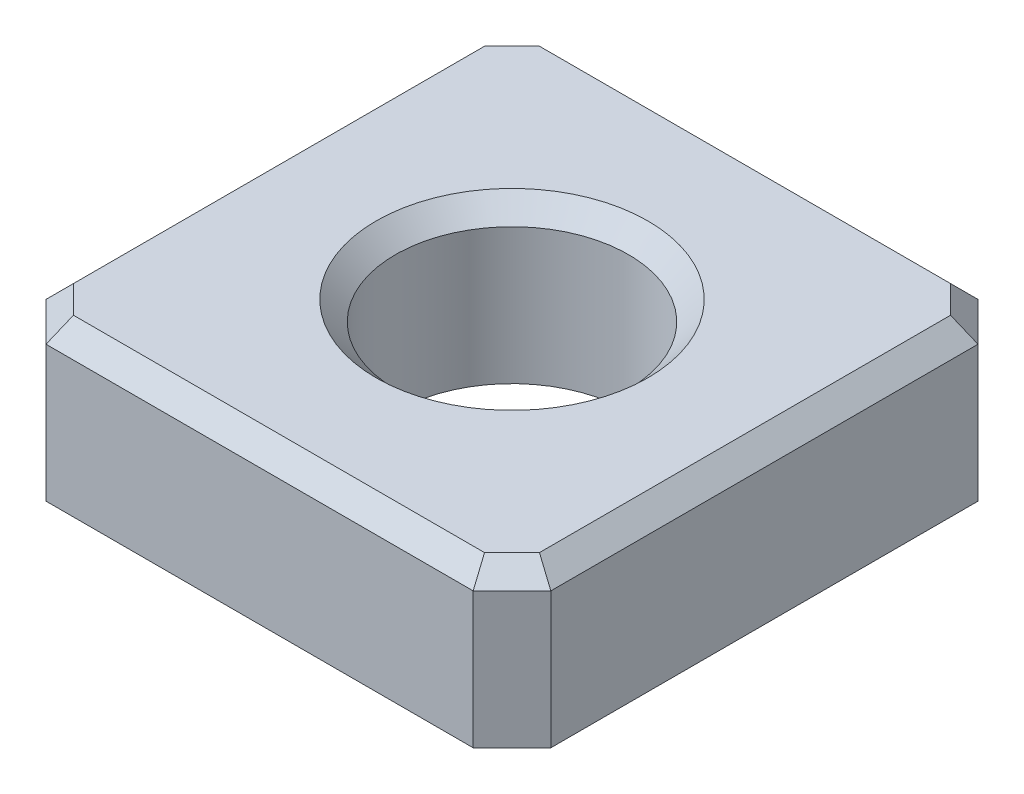
ISO-10303-21;
HEADER;
FILE_DESCRIPTION(('STEP AP214'),'2;1');
FILE_NAME('part.step','',(''),(''),'','','');
FILE_SCHEMA(('AUTOMOTIVE_DESIGN { 1 0 10303 214 1 1 1 1 }'));
ENDSEC;
DATA;
#1=APPLICATION_CONTEXT('core data for automotive mechanical design processes');
#2=APPLICATION_PROTOCOL_DEFINITION('international standard','automotive_design',2000,#1);
#3=PRODUCT_CONTEXT('',#1,'mechanical');
#4=PRODUCT('Part','Part','',(#3));
#5=PRODUCT_RELATED_PRODUCT_CATEGORY('part','',(#4));
#6=PRODUCT_DEFINITION_FORMATION('','',#4);
#7=PRODUCT_DEFINITION_CONTEXT('part definition',#1,'design');
#8=PRODUCT_DEFINITION('design','',#6,#7);
#9=PRODUCT_DEFINITION_SHAPE('','',#8);
#10=(LENGTH_UNIT() NAMED_UNIT(*) SI_UNIT(.MILLI.,.METRE.));
#11=(NAMED_UNIT(*) PLANE_ANGLE_UNIT() SI_UNIT($,.RADIAN.));
#12=(NAMED_UNIT(*) SI_UNIT($,.STERADIAN.) SOLID_ANGLE_UNIT());
#13=UNCERTAINTY_MEASURE_WITH_UNIT(LENGTH_MEASURE(1.E-05),#10,'distance_accuracy_value','');
#14=(GEOMETRIC_REPRESENTATION_CONTEXT(3) GLOBAL_UNCERTAINTY_ASSIGNED_CONTEXT((#13)) GLOBAL_UNIT_ASSIGNED_CONTEXT((#10,
#11,#12)) REPRESENTATION_CONTEXT('',''));
#15=CARTESIAN_POINT('',(0.,0.,0.));
#16=DIRECTION('',(0.,0.,1.));
#17=DIRECTION('',(1.,0.,0.));
#18=AXIS2_PLACEMENT_3D('',#15,#16,#17);
#19=CARTESIAN_POINT('',(0.,4.,0.));
#20=DIRECTION('',(0.,1.,0.));
#21=DIRECTION('',(0.,0.,1.));
#22=AXIS2_PLACEMENT_3D('',#19,#20,#21);
#23=PLANE('',#22);
#24=CARTESIAN_POINT('',(0.,4.,0.));
#25=DIRECTION('',(0.,1.,0.));
#26=DIRECTION('',(0.,0.,1.));
#27=AXIS2_PLACEMENT_3D('',#24,#25,#26);
#28=CIRCLE('',#27,3.5);
#29=CARTESIAN_POINT('',(0.,4.,3.5));
#30=VERTEX_POINT('',#29);
#31=EDGE_CURVE('E225',#30,#30,#28,.F.);
#32=ORIENTED_EDGE('',*,*,#31,.T.);
#33=EDGE_LOOP('',(#32));
#34=FACE_BOUND('',#33,.T.);
#35=DIRECTION('',(0.,0.,-1.));
#36=VECTOR('',#35,1.);
#37=CARTESIAN_POINT('',(6.00000000000003,4.,-5.5));
#38=LINE('',#37,#36);
#39=CARTESIAN_POINT('',(6.00000000000003,4.,5.29289321881345));
#40=VERTEX_POINT('',#39);
#41=CARTESIAN_POINT('',(6.00000000000003,4.,-5.29289321881345));
#42=VERTEX_POINT('',#41);
#43=EDGE_CURVE('E218',#40,#42,#38,.T.);
#44=ORIENTED_EDGE('',*,*,#43,.T.);
#45=DIRECTION('',(-0.707106781186546,0.,-0.707106781186549));
#46=VECTOR('',#45,1.);
#47=CARTESIAN_POINT('',(5.64644660940675,4.,-5.64644660940673));
#48=LINE('',#47,#46);
#49=CARTESIAN_POINT('',(5.29289321881349,4.,-6.));
#50=VERTEX_POINT('',#49);
#51=EDGE_CURVE('E221',#42,#50,#48,.T.);
#52=ORIENTED_EDGE('',*,*,#51,.T.);
#53=DIRECTION('',(-1.,0.,0.));
#54=VECTOR('',#53,1.);
#55=CARTESIAN_POINT('',(-5.50000000000003,4.,-6.));
#56=LINE('',#55,#54);
#57=CARTESIAN_POINT('',(-5.29289321881348,4.,-6.));
#58=VERTEX_POINT('',#57);
#59=EDGE_CURVE('E200',#50,#58,#56,.T.);
#60=ORIENTED_EDGE('',*,*,#59,.T.);
#61=DIRECTION('',(-0.707106781186549,0.,0.707106781186546));
#62=VECTOR('',#61,1.);
#63=CARTESIAN_POINT('',(-5.64644660940673,4.,-5.64644660940675));
#64=LINE('',#63,#62);
#65=CARTESIAN_POINT('',(-6.00000000000003,4.,-5.29289321881345));
#66=VERTEX_POINT('',#65);
#67=EDGE_CURVE('E203',#58,#66,#64,.T.);
#68=ORIENTED_EDGE('',*,*,#67,.T.);
#69=DIRECTION('',(0.,0.,1.));
#70=VECTOR('',#69,1.);
#71=CARTESIAN_POINT('',(-6.00000000000003,4.,5.5));
#72=LINE('',#71,#70);
#73=CARTESIAN_POINT('',(-6.00000000000003,4.,5.29289321881345));
#74=VERTEX_POINT('',#73);
#75=EDGE_CURVE('E206',#66,#74,#72,.T.);
#76=ORIENTED_EDGE('',*,*,#75,.T.);
#77=DIRECTION('',(0.707106781186546,0.,0.707106781186549));
#78=VECTOR('',#77,1.);
#79=CARTESIAN_POINT('',(-5.64644660940675,4.,5.64644660940673));
#80=LINE('',#79,#78);
#81=CARTESIAN_POINT('',(-5.29289321881349,4.,6.));
#82=VERTEX_POINT('',#81);
#83=EDGE_CURVE('E209',#74,#82,#80,.T.);
#84=ORIENTED_EDGE('',*,*,#83,.T.);
#85=DIRECTION('',(1.,0.,0.));
#86=VECTOR('',#85,1.);
#87=CARTESIAN_POINT('',(5.50000000000003,4.,6.));
#88=LINE('',#87,#86);
#89=CARTESIAN_POINT('',(5.29289321881348,4.,6.));
#90=VERTEX_POINT('',#89);
#91=EDGE_CURVE('E212',#82,#90,#88,.T.);
#92=ORIENTED_EDGE('',*,*,#91,.T.);
#93=DIRECTION('',(0.707106781186549,0.,-0.707106781186546));
#94=VECTOR('',#93,1.);
#95=CARTESIAN_POINT('',(5.64644660940673,4.,5.64644660940675));
#96=LINE('',#95,#94);
#97=EDGE_CURVE('E215',#90,#40,#96,.T.);
#98=ORIENTED_EDGE('',*,*,#97,.T.);
#99=EDGE_LOOP('',(#44,#52,#60,#68,#76,#84,#92,#98));
#100=FACE_BOUND('',#99,.T.);
#101=ADVANCED_FACE('F41',(#34,#100),#23,.T.);
#102=CARTESIAN_POINT('',(0.,0.,0.));
#103=DIRECTION('',(0.,1.,0.));
#104=DIRECTION('',(0.,0.,1.));
#105=AXIS2_PLACEMENT_3D('',#102,#103,#104);
#106=PLANE('',#105);
#107=DIRECTION('',(0.,0.,1.));
#108=VECTOR('',#107,1.);
#109=CARTESIAN_POINT('',(-6.50000000000003,0.,-6.5));
#110=LINE('',#109,#108);
#111=CARTESIAN_POINT('',(-6.50000000000003,0.,-5.5));
#112=VERTEX_POINT('',#111);
#113=CARTESIAN_POINT('',(-6.50000000000003,0.,5.5));
#114=VERTEX_POINT('',#113);
#115=EDGE_CURVE('E136',#112,#114,#110,.T.);
#116=ORIENTED_EDGE('',*,*,#115,.F.);
#117=DIRECTION('',(-0.707106781186549,0.,0.707106781186546));
#118=VECTOR('',#117,1.);
#119=CARTESIAN_POINT('',(-6.50000000000003,0.,-5.5));
#120=LINE('',#119,#118);
#121=CARTESIAN_POINT('',(-5.50000000000003,0.,-6.5));
#122=VERTEX_POINT('',#121);
#123=EDGE_CURVE('E143',#112,#122,#120,.F.);
#124=ORIENTED_EDGE('',*,*,#123,.T.);
#125=DIRECTION('',(-1.,0.,0.));
#126=VECTOR('',#125,1.);
#127=CARTESIAN_POINT('',(-6.50000000000003,0.,-6.5));
#128=LINE('',#127,#126);
#129=CARTESIAN_POINT('',(5.50000000000003,0.,-6.5));
#130=VERTEX_POINT('',#129);
#131=EDGE_CURVE('E159',#130,#122,#128,.T.);
#132=ORIENTED_EDGE('',*,*,#131,.F.);
#133=DIRECTION('',(-0.707106781186546,0.,-0.707106781186549));
#134=VECTOR('',#133,1.);
#135=CARTESIAN_POINT('',(5.50000000000003,0.,-6.5));
#136=LINE('',#135,#134);
#137=CARTESIAN_POINT('',(6.50000000000003,0.,-5.5));
#138=VERTEX_POINT('',#137);
#139=EDGE_CURVE('E173',#130,#138,#136,.F.);
#140=ORIENTED_EDGE('',*,*,#139,.T.);
#141=DIRECTION('',(0.,0.,-1.));
#142=VECTOR('',#141,1.);
#143=CARTESIAN_POINT('',(6.50000000000003,0.,-6.5));
#144=LINE('',#143,#142);
#145=CARTESIAN_POINT('',(6.50000000000003,0.,5.5));
#146=VERTEX_POINT('',#145);
#147=EDGE_CURVE('E165',#146,#138,#144,.T.);
#148=ORIENTED_EDGE('',*,*,#147,.F.);
#149=DIRECTION('',(0.707106781186549,0.,-0.707106781186546));
#150=VECTOR('',#149,1.);
#151=CARTESIAN_POINT('',(6.50000000000003,0.,5.5));
#152=LINE('',#151,#150);
#153=CARTESIAN_POINT('',(5.50000000000003,0.,6.5));
#154=VERTEX_POINT('',#153);
#155=EDGE_CURVE('E140',#146,#154,#152,.F.);
#156=ORIENTED_EDGE('',*,*,#155,.T.);
#157=DIRECTION('',(1.,0.,0.));
#158=VECTOR('',#157,1.);
#159=CARTESIAN_POINT('',(-6.50000000000003,0.,6.5));
#160=LINE('',#159,#158);
#161=CARTESIAN_POINT('',(-5.50000000000003,0.,6.5));
#162=VERTEX_POINT('',#161);
#163=EDGE_CURVE('E158',#162,#154,#160,.T.);
#164=ORIENTED_EDGE('',*,*,#163,.F.);
#165=DIRECTION('',(0.707106781186546,0.,0.707106781186549));
#166=VECTOR('',#165,1.);
#167=CARTESIAN_POINT('',(-5.50000000000003,0.,6.5));
#168=LINE('',#167,#166);
#169=EDGE_CURVE('E151',#162,#114,#168,.F.);
#170=ORIENTED_EDGE('',*,*,#169,.T.);
#171=EDGE_LOOP('',(#116,#124,#132,#140,#148,#156,#164,#170));
#172=FACE_BOUND('',#171,.T.);
#173=CARTESIAN_POINT('',(0.,0.,0.));
#174=DIRECTION('',(0.,1.,0.));
#175=DIRECTION('',(0.,0.,1.));
#176=AXIS2_PLACEMENT_3D('',#173,#174,#175);
#177=CIRCLE('',#176,3.);
#178=CARTESIAN_POINT('',(0.,0.,3.));
#179=VERTEX_POINT('',#178);
#180=EDGE_CURVE('E278',#179,#179,#177,.T.);
#181=ORIENTED_EDGE('',*,*,#180,.T.);
#182=EDGE_LOOP('',(#181));
#183=FACE_BOUND('',#182,.T.);
#184=ADVANCED_FACE('F153',(#172,#183),#106,.F.);
#185=CARTESIAN_POINT('',(6.50000000000003,4.,-6.5));
#186=DIRECTION('',(-1.,0.,0.));
#187=DIRECTION('',(0.,0.,1.));
#188=AXIS2_PLACEMENT_3D('',#185,#186,#187);
#189=PLANE('',#188);
#190=DIRECTION('',(0.,1.,0.));
#191=VECTOR('',#190,1.);
#192=CARTESIAN_POINT('',(6.50000000000003,4.,-5.5));
#193=LINE('',#192,#191);
#194=CARTESIAN_POINT('',(6.50000000000003,3.5,-5.5));
#195=VERTEX_POINT('',#194);
#196=EDGE_CURVE('E192',#138,#195,#193,.T.);
#197=ORIENTED_EDGE('',*,*,#196,.T.);
#198=DIRECTION('',(0.,0.,1.));
#199=VECTOR('',#198,1.);
#200=CARTESIAN_POINT('',(6.50000000000003,3.5,5.5));
#201=LINE('',#200,#199);
#202=CARTESIAN_POINT('',(6.50000000000003,3.5,5.5));
#203=VERTEX_POINT('',#202);
#204=EDGE_CURVE('E233',#195,#203,#201,.T.);
#205=ORIENTED_EDGE('',*,*,#204,.T.);
#206=DIRECTION('',(0.,-1.,0.));
#207=VECTOR('',#206,1.);
#208=CARTESIAN_POINT('',(6.50000000000003,4.,5.5));
#209=LINE('',#208,#207);
#210=EDGE_CURVE('E189',#203,#146,#209,.T.);
#211=ORIENTED_EDGE('',*,*,#210,.T.);
#212=ORIENTED_EDGE('',*,*,#147,.T.);
#213=EDGE_LOOP('',(#197,#205,#211,#212));
#214=FACE_BOUND('',#213,.T.);
#215=ADVANCED_FACE('F292',(#214),#189,.F.);
#216=CARTESIAN_POINT('',(-6.50000000000003,4.,-6.5));
#217=DIRECTION('',(0.,0.,1.));
#218=DIRECTION('',(1.,0.,0.));
#219=AXIS2_PLACEMENT_3D('',#216,#217,#218);
#220=PLANE('',#219);
#221=DIRECTION('',(0.,1.,0.));
#222=VECTOR('',#221,1.);
#223=CARTESIAN_POINT('',(-5.50000000000003,4.,-6.5));
#224=LINE('',#223,#222);
#225=CARTESIAN_POINT('',(-5.50000000000003,3.5,-6.5));
#226=VERTEX_POINT('',#225);
#227=EDGE_CURVE('E145',#122,#226,#224,.T.);
#228=ORIENTED_EDGE('',*,*,#227,.T.);
#229=DIRECTION('',(1.,0.,0.));
#230=VECTOR('',#229,1.);
#231=CARTESIAN_POINT('',(5.50000000000003,3.5,-6.5));
#232=LINE('',#231,#230);
#233=CARTESIAN_POINT('',(5.50000000000003,3.5,-6.5));
#234=VERTEX_POINT('',#233);
#235=EDGE_CURVE('E11',#226,#234,#232,.T.);
#236=ORIENTED_EDGE('',*,*,#235,.T.);
#237=DIRECTION('',(0.,-1.,0.));
#238=VECTOR('',#237,1.);
#239=CARTESIAN_POINT('',(5.50000000000003,4.,-6.5));
#240=LINE('',#239,#238);
#241=EDGE_CURVE('E150',#234,#130,#240,.T.);
#242=ORIENTED_EDGE('',*,*,#241,.T.);
#243=ORIENTED_EDGE('',*,*,#131,.T.);
#244=EDGE_LOOP('',(#228,#236,#242,#243));
#245=FACE_BOUND('',#244,.T.);
#246=ADVANCED_FACE('F360',(#245),#220,.F.);
#247=CARTESIAN_POINT('',(-6.50000000000003,4.,-6.5));
#248=DIRECTION('',(1.,0.,0.));
#249=DIRECTION('',(0.,0.,-1.));
#250=AXIS2_PLACEMENT_3D('',#247,#248,#249);
#251=PLANE('',#250);
#252=DIRECTION('',(0.,1.,0.));
#253=VECTOR('',#252,1.);
#254=CARTESIAN_POINT('',(-6.50000000000003,4.,5.5));
#255=LINE('',#254,#253);
#256=CARTESIAN_POINT('',(-6.50000000000003,3.5,5.5));
#257=VERTEX_POINT('',#256);
#258=EDGE_CURVE('E141',#114,#257,#255,.T.);
#259=ORIENTED_EDGE('',*,*,#258,.T.);
#260=DIRECTION('',(0.,0.,-1.));
#261=VECTOR('',#260,1.);
#262=CARTESIAN_POINT('',(-6.50000000000003,3.5,-5.5));
#263=LINE('',#262,#261);
#264=CARTESIAN_POINT('',(-6.50000000000003,3.5,-5.5));
#265=VERTEX_POINT('',#264);
#266=EDGE_CURVE('E67',#257,#265,#263,.T.);
#267=ORIENTED_EDGE('',*,*,#266,.T.);
#268=DIRECTION('',(0.,-1.,0.));
#269=VECTOR('',#268,1.);
#270=CARTESIAN_POINT('',(-6.50000000000003,4.,-5.5));
#271=LINE('',#270,#269);
#272=EDGE_CURVE('E132',#265,#112,#271,.T.);
#273=ORIENTED_EDGE('',*,*,#272,.T.);
#274=ORIENTED_EDGE('',*,*,#115,.T.);
#275=EDGE_LOOP('',(#259,#267,#273,#274));
#276=FACE_BOUND('',#275,.T.);
#277=ADVANCED_FACE('F134',(#276),#251,.F.);
#278=CARTESIAN_POINT('',(-6.50000000000003,4.,6.5));
#279=DIRECTION('',(0.,0.,-1.));
#280=DIRECTION('',(-1.,0.,0.));
#281=AXIS2_PLACEMENT_3D('',#278,#279,#280);
#282=PLANE('',#281);
#283=DIRECTION('',(0.,1.,0.));
#284=VECTOR('',#283,1.);
#285=CARTESIAN_POINT('',(5.50000000000003,4.,6.5));
#286=LINE('',#285,#284);
#287=CARTESIAN_POINT('',(5.50000000000003,3.5,6.5));
#288=VERTEX_POINT('',#287);
#289=EDGE_CURVE('E182',#154,#288,#286,.T.);
#290=ORIENTED_EDGE('',*,*,#289,.T.);
#291=DIRECTION('',(-1.,0.,0.));
#292=VECTOR('',#291,1.);
#293=CARTESIAN_POINT('',(-5.50000000000003,3.5,6.5));
#294=LINE('',#293,#292);
#295=CARTESIAN_POINT('',(-5.50000000000003,3.5,6.5));
#296=VERTEX_POINT('',#295);
#297=EDGE_CURVE('E239',#288,#296,#294,.T.);
#298=ORIENTED_EDGE('',*,*,#297,.T.);
#299=DIRECTION('',(0.,-1.,0.));
#300=VECTOR('',#299,1.);
#301=CARTESIAN_POINT('',(-5.50000000000003,4.,6.5));
#302=LINE('',#301,#300);
#303=EDGE_CURVE('E186',#296,#162,#302,.T.);
#304=ORIENTED_EDGE('',*,*,#303,.T.);
#305=ORIENTED_EDGE('',*,*,#163,.T.);
#306=EDGE_LOOP('',(#290,#298,#304,#305));
#307=FACE_BOUND('',#306,.T.);
#308=ADVANCED_FACE('F328',(#307),#282,.F.);
#309=CARTESIAN_POINT('',(0.,4.,0.));
#310=DIRECTION('',(0.,-1.,0.));
#311=DIRECTION('',(0.,0.,-1.));
#312=AXIS2_PLACEMENT_3D('',#309,#310,#311);
#313=CYLINDRICAL_SURFACE('',#312,3.);
#314=CARTESIAN_POINT('',(0.,3.5,0.));
#315=DIRECTION('',(0.,1.,0.));
#316=DIRECTION('',(0.,0.,1.));
#317=AXIS2_PLACEMENT_3D('',#314,#315,#316);
#318=CIRCLE('',#317,3.);
#319=CARTESIAN_POINT('',(0.,3.5,3.));
#320=VERTEX_POINT('',#319);
#321=EDGE_CURVE('E196',#320,#320,#318,.T.);
#322=ORIENTED_EDGE('',*,*,#321,.T.);
#323=EDGE_LOOP('',(#322));
#324=FACE_BOUND('',#323,.T.);
#325=ORIENTED_EDGE('',*,*,#180,.F.);
#326=EDGE_LOOP('',(#325));
#327=FACE_BOUND('',#326,.T.);
#328=ADVANCED_FACE('F354',(#324,#327),#313,.F.);
#329=CARTESIAN_POINT('',(-6.50000000000003,4.,-5.5));
#330=DIRECTION('',(0.707106781186546,0.,0.707106781186549));
#331=DIRECTION('',(0.,-1.,0.));
#332=AXIS2_PLACEMENT_3D('',#329,#330,#331);
#333=PLANE('',#332);
#334=ORIENTED_EDGE('',*,*,#272,.F.);
#335=DIRECTION('',(-0.707106781186549,0.,0.707106781186546));
#336=VECTOR('',#335,1.);
#337=CARTESIAN_POINT('',(-6.50000000000003,3.5,-5.5));
#338=LINE('',#337,#336);
#339=EDGE_CURVE('E52',#265,#226,#338,.F.);
#340=ORIENTED_EDGE('',*,*,#339,.T.);
#341=ORIENTED_EDGE('',*,*,#227,.F.);
#342=ORIENTED_EDGE('',*,*,#123,.F.);
#343=EDGE_LOOP('',(#334,#340,#341,#342));
#344=FACE_BOUND('',#343,.T.);
#345=ADVANCED_FACE('F144',(#344),#333,.F.);
#346=CARTESIAN_POINT('',(-5.50000000000003,4.,6.5));
#347=DIRECTION('',(0.707106781186549,0.,-0.707106781186546));
#348=DIRECTION('',(0.,-1.,0.));
#349=AXIS2_PLACEMENT_3D('',#346,#347,#348);
#350=PLANE('',#349);
#351=ORIENTED_EDGE('',*,*,#303,.F.);
#352=DIRECTION('',(0.707106781186546,0.,0.707106781186549));
#353=VECTOR('',#352,1.);
#354=CARTESIAN_POINT('',(-5.50000000000003,3.5,6.5));
#355=LINE('',#354,#353);
#356=EDGE_CURVE('E242',#296,#257,#355,.F.);
#357=ORIENTED_EDGE('',*,*,#356,.T.);
#358=ORIENTED_EDGE('',*,*,#258,.F.);
#359=ORIENTED_EDGE('',*,*,#169,.F.);
#360=EDGE_LOOP('',(#351,#357,#358,#359));
#361=FACE_BOUND('',#360,.T.);
#362=ADVANCED_FACE('F331',(#361),#350,.F.);
#363=CARTESIAN_POINT('',(5.50000000000003,4.,-6.5));
#364=DIRECTION('',(-0.707106781186549,0.,0.707106781186546));
#365=DIRECTION('',(0.,-1.,0.));
#366=AXIS2_PLACEMENT_3D('',#363,#364,#365);
#367=PLANE('',#366);
#368=ORIENTED_EDGE('',*,*,#241,.F.);
#369=DIRECTION('',(-0.707106781186546,0.,-0.707106781186549));
#370=VECTOR('',#369,1.);
#371=CARTESIAN_POINT('',(5.50000000000003,3.5,-6.5));
#372=LINE('',#371,#370);
#373=EDGE_CURVE('E229',#234,#195,#372,.F.);
#374=ORIENTED_EDGE('',*,*,#373,.T.);
#375=ORIENTED_EDGE('',*,*,#196,.F.);
#376=ORIENTED_EDGE('',*,*,#139,.F.);
#377=EDGE_LOOP('',(#368,#374,#375,#376));
#378=FACE_BOUND('',#377,.T.);
#379=ADVANCED_FACE('F298',(#378),#367,.F.);
#380=CARTESIAN_POINT('',(6.50000000000003,4.,5.5));
#381=DIRECTION('',(-0.707106781186546,0.,-0.707106781186549));
#382=DIRECTION('',(0.,-1.,0.));
#383=AXIS2_PLACEMENT_3D('',#380,#381,#382);
#384=PLANE('',#383);
#385=ORIENTED_EDGE('',*,*,#210,.F.);
#386=DIRECTION('',(0.707106781186549,0.,-0.707106781186546));
#387=VECTOR('',#386,1.);
#388=CARTESIAN_POINT('',(6.50000000000003,3.5,5.5));
#389=LINE('',#388,#387);
#390=EDGE_CURVE('E236',#203,#288,#389,.F.);
#391=ORIENTED_EDGE('',*,*,#390,.T.);
#392=ORIENTED_EDGE('',*,*,#289,.F.);
#393=ORIENTED_EDGE('',*,*,#155,.F.);
#394=EDGE_LOOP('',(#385,#391,#392,#393));
#395=FACE_BOUND('',#394,.T.);
#396=ADVANCED_FACE('F320',(#395),#384,.F.);
#397=CARTESIAN_POINT('',(0.,3.5,0.));
#398=DIRECTION('',(0.,1.,0.));
#399=DIRECTION('',(0.,0.,1.));
#400=AXIS2_PLACEMENT_3D('',#397,#398,#399);
#401=CONICAL_SURFACE('',#400,3.,0.78539816339745);
#402=ORIENTED_EDGE('',*,*,#31,.F.);
#403=EDGE_LOOP('',(#402));
#404=FACE_BOUND('',#403,.T.);
#405=ORIENTED_EDGE('',*,*,#321,.F.);
#406=EDGE_LOOP('',(#405));
#407=FACE_BOUND('',#406,.T.);
#408=ADVANCED_FACE('F387',(#404,#407),#401,.F.);
#409=CARTESIAN_POINT('',(-5.64644660940675,4.,5.64644660940673));
#410=DIRECTION('',(-0.5,0.707106781186548,0.499999999999999));
#411=DIRECTION('',(-0.707106781186546,0.,-0.707106781186549));
#412=AXIS2_PLACEMENT_3D('',#409,#410,#411);
#413=PLANE('',#412);
#414=DIRECTION('',(0.678598344545847,0.678598344545847,-0.281084637714821));
#415=VECTOR('',#414,1.);
#416=CARTESIAN_POINT('',(-4.99041465271166,5.00958534728837,4.87470927559345));
#417=LINE('',#416,#415);
#418=EDGE_CURVE('E270',#257,#74,#417,.T.);
#419=ORIENTED_EDGE('',*,*,#418,.F.);
#420=ORIENTED_EDGE('',*,*,#356,.F.);
#421=DIRECTION('',(0.281084637714823,0.678598344545847,-0.678598344545847));
#422=VECTOR('',#421,1.);
#423=CARTESIAN_POINT('',(-5.25338893203385,4.09537178491527,5.90462821508473));
#424=LINE('',#423,#422);
#425=EDGE_CURVE('E46',#82,#296,#424,.F.);
#426=ORIENTED_EDGE('',*,*,#425,.F.);
#427=ORIENTED_EDGE('',*,*,#83,.F.);
#428=EDGE_LOOP('',(#419,#420,#426,#427));
#429=FACE_BOUND('',#428,.T.);
#430=ADVANCED_FACE('F44',(#429),#413,.T.);
#431=CARTESIAN_POINT('',(0.,4.,6.));
#432=DIRECTION('',(0.,0.707106781186547,0.707106781186547));
#433=DIRECTION('',(-1.,0.,0.));
#434=AXIS2_PLACEMENT_3D('',#431,#432,#433);
#435=PLANE('',#434);
#436=ORIENTED_EDGE('',*,*,#425,.T.);
#437=ORIENTED_EDGE('',*,*,#297,.F.);
#438=DIRECTION('',(-0.281084637714821,0.678598344545847,-0.678598344545847));
#439=VECTOR('',#438,1.);
#440=CARTESIAN_POINT('',(4.87470927559348,5.00958534728838,4.99041465271162));
#441=LINE('',#440,#439);
#442=EDGE_CURVE('E267',#90,#288,#441,.F.);
#443=ORIENTED_EDGE('',*,*,#442,.F.);
#444=ORIENTED_EDGE('',*,*,#91,.F.);
#445=EDGE_LOOP('',(#436,#437,#443,#444));
#446=FACE_BOUND('',#445,.T.);
#447=ADVANCED_FACE('F325',(#446),#435,.T.);
#448=CARTESIAN_POINT('',(-6.00000000000003,4.,0.));
#449=DIRECTION('',(-0.707106781186547,0.707106781186547,0.));
#450=DIRECTION('',(0.,0.,-1.));
#451=AXIS2_PLACEMENT_3D('',#448,#449,#450);
#452=PLANE('',#451);
#453=ORIENTED_EDGE('',*,*,#418,.T.);
#454=ORIENTED_EDGE('',*,*,#75,.F.);
#455=DIRECTION('',(0.678598344545847,0.678598344545847,0.281084637714822));
#456=VECTOR('',#455,1.);
#457=CARTESIAN_POINT('',(-5.90462821508475,4.09537178491528,-5.25338893203381));
#458=LINE('',#457,#456);
#459=EDGE_CURVE('E263',#265,#66,#458,.T.);
#460=ORIENTED_EDGE('',*,*,#459,.F.);
#461=ORIENTED_EDGE('',*,*,#266,.F.);
#462=EDGE_LOOP('',(#453,#454,#460,#461));
#463=FACE_BOUND('',#462,.T.);
#464=ADVANCED_FACE('F334',(#463),#452,.T.);
#465=CARTESIAN_POINT('',(5.64644660940673,4.,5.64644660940675));
#466=DIRECTION('',(0.499999999999999,0.707106781186548,0.500000000000001));
#467=DIRECTION('',(-0.707106781186549,0.,0.707106781186546));
#468=AXIS2_PLACEMENT_3D('',#465,#466,#467);
#469=PLANE('',#468);
#470=ORIENTED_EDGE('',*,*,#442,.T.);
#471=ORIENTED_EDGE('',*,*,#390,.F.);
#472=DIRECTION('',(-0.678598344545847,0.678598344545847,-0.281084637714822));
#473=VECTOR('',#472,1.);
#474=CARTESIAN_POINT('',(5.90462821508475,4.09537178491528,5.25338893203381));
#475=LINE('',#474,#473);
#476=EDGE_CURVE('E259',#40,#203,#475,.F.);
#477=ORIENTED_EDGE('',*,*,#476,.F.);
#478=ORIENTED_EDGE('',*,*,#97,.F.);
#479=EDGE_LOOP('',(#470,#471,#477,#478));
#480=FACE_BOUND('',#479,.T.);
#481=ADVANCED_FACE('F323',(#480),#469,.T.);
#482=CARTESIAN_POINT('',(-5.64644660940673,4.,-5.64644660940675));
#483=DIRECTION('',(-0.499999999999999,0.707106781186548,-0.500000000000001));
#484=DIRECTION('',(0.707106781186549,0.,-0.707106781186546));
#485=AXIS2_PLACEMENT_3D('',#482,#483,#484);
#486=PLANE('',#485);
#487=ORIENTED_EDGE('',*,*,#459,.T.);
#488=ORIENTED_EDGE('',*,*,#67,.F.);
#489=DIRECTION('',(0.281084637714821,0.678598344545847,0.678598344545847));
#490=VECTOR('',#489,1.);
#491=CARTESIAN_POINT('',(-4.87470927559348,5.00958534728838,-4.99041465271162));
#492=LINE('',#491,#490);
#493=EDGE_CURVE('E255',#226,#58,#492,.T.);
#494=ORIENTED_EDGE('',*,*,#493,.F.);
#495=ORIENTED_EDGE('',*,*,#339,.F.);
#496=EDGE_LOOP('',(#487,#488,#494,#495));
#497=FACE_BOUND('',#496,.T.);
#498=ADVANCED_FACE('F336',(#497),#486,.T.);
#499=CARTESIAN_POINT('',(6.00000000000003,4.,0.));
#500=DIRECTION('',(0.707106781186547,0.707106781186547,0.));
#501=DIRECTION('',(0.,0.,1.));
#502=AXIS2_PLACEMENT_3D('',#499,#500,#501);
#503=PLANE('',#502);
#504=ORIENTED_EDGE('',*,*,#476,.T.);
#505=ORIENTED_EDGE('',*,*,#204,.F.);
#506=DIRECTION('',(-0.678598344545847,0.678598344545847,0.281084637714821));
#507=VECTOR('',#506,1.);
#508=CARTESIAN_POINT('',(4.99041465271166,5.00958534728837,-4.87470927559345));
#509=LINE('',#508,#507);
#510=EDGE_CURVE('E252',#42,#195,#509,.F.);
#511=ORIENTED_EDGE('',*,*,#510,.F.);
#512=ORIENTED_EDGE('',*,*,#43,.F.);
#513=EDGE_LOOP('',(#504,#505,#511,#512));
#514=FACE_BOUND('',#513,.T.);
#515=ADVANCED_FACE('F317',(#514),#503,.T.);
#516=CARTESIAN_POINT('',(0.,4.,-6.));
#517=DIRECTION('',(0.,0.707106781186547,-0.707106781186547));
#518=DIRECTION('',(1.,0.,0.));
#519=AXIS2_PLACEMENT_3D('',#516,#517,#518);
#520=PLANE('',#519);
#521=ORIENTED_EDGE('',*,*,#493,.T.);
#522=ORIENTED_EDGE('',*,*,#59,.F.);
#523=DIRECTION('',(0.281084637714823,-0.678598344545847,-0.678598344545847));
#524=VECTOR('',#523,1.);
#525=CARTESIAN_POINT('',(4.87470927559348,5.00958534728838,-4.99041465271162));
#526=LINE('',#525,#524);
#527=EDGE_CURVE('E249',#234,#50,#526,.F.);
#528=ORIENTED_EDGE('',*,*,#527,.F.);
#529=ORIENTED_EDGE('',*,*,#235,.F.);
#530=EDGE_LOOP('',(#521,#522,#528,#529));
#531=FACE_BOUND('',#530,.T.);
#532=ADVANCED_FACE('F309',(#531),#520,.T.);
#533=CARTESIAN_POINT('',(5.64644660940675,4.,-5.64644660940673));
#534=DIRECTION('',(0.5,0.707106781186548,-0.499999999999999));
#535=DIRECTION('',(0.707106781186546,0.,0.707106781186549));
#536=AXIS2_PLACEMENT_3D('',#533,#534,#535);
#537=PLANE('',#536);
#538=ORIENTED_EDGE('',*,*,#510,.T.);
#539=ORIENTED_EDGE('',*,*,#373,.F.);
#540=ORIENTED_EDGE('',*,*,#527,.T.);
#541=ORIENTED_EDGE('',*,*,#51,.F.);
#542=EDGE_LOOP('',(#538,#539,#540,#541));
#543=FACE_BOUND('',#542,.T.);
#544=ADVANCED_FACE('F302',(#543),#537,.T.);
#545=CLOSED_SHELL('',(#101,#184,#215,#246,#277,#308,#328,#345,#362,#379,#396,#408,#430,#447,
#464,#481,#498,#515,#532,#544));
#546=MANIFOLD_SOLID_BREP('B2',#545);
#547=ADVANCED_BREP_SHAPE_REPRESENTATION('',(#18,#546),#14);
#548=SHAPE_DEFINITION_REPRESENTATION(#9,#547);
ENDSEC;
END-ISO-10303-21;
